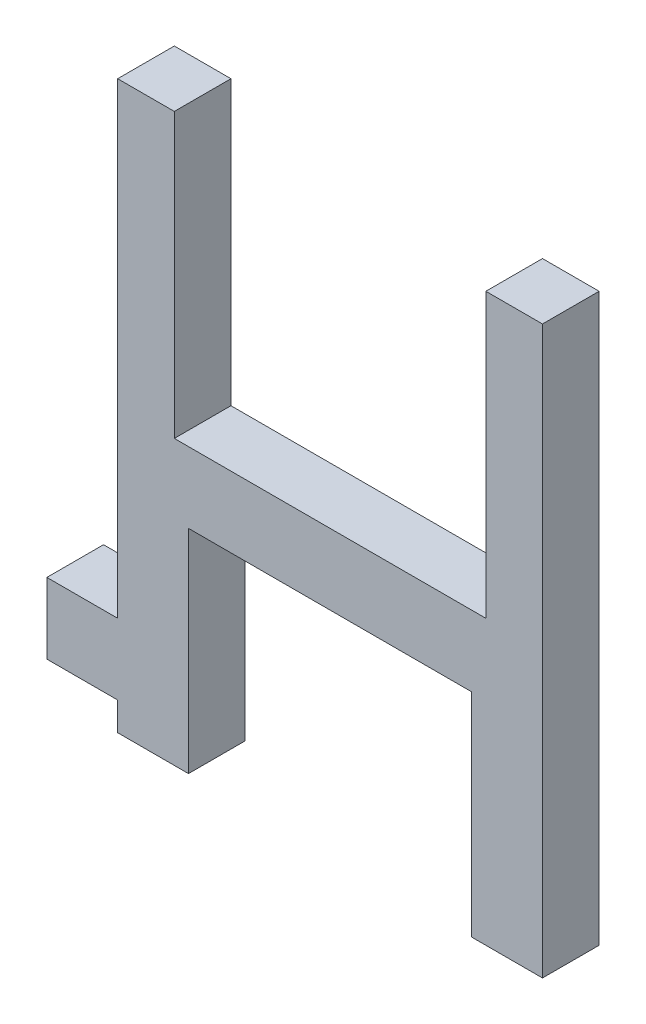
ISO-10303-21;
HEADER;
FILE_DESCRIPTION(('STEP AP214'),'2;1');
FILE_NAME('part.step','',(''),(''),'','','');
FILE_SCHEMA(('AUTOMOTIVE_DESIGN { 1 0 10303 214 1 1 1 1 }'));
ENDSEC;
DATA;
#1=APPLICATION_CONTEXT('core data for automotive mechanical design processes');
#2=APPLICATION_PROTOCOL_DEFINITION('international standard','automotive_design',2000,#1);
#3=PRODUCT_CONTEXT('',#1,'mechanical');
#4=PRODUCT('Part','Part','',(#3));
#5=PRODUCT_RELATED_PRODUCT_CATEGORY('part','',(#4));
#6=PRODUCT_DEFINITION_FORMATION('','',#4);
#7=PRODUCT_DEFINITION_CONTEXT('part definition',#1,'design');
#8=PRODUCT_DEFINITION('design','',#6,#7);
#9=PRODUCT_DEFINITION_SHAPE('','',#8);
#10=(LENGTH_UNIT() NAMED_UNIT(*) SI_UNIT(.MILLI.,.METRE.));
#11=(NAMED_UNIT(*) PLANE_ANGLE_UNIT() SI_UNIT($,.RADIAN.));
#12=(NAMED_UNIT(*) SI_UNIT($,.STERADIAN.) SOLID_ANGLE_UNIT());
#13=UNCERTAINTY_MEASURE_WITH_UNIT(LENGTH_MEASURE(1.E-05),#10,'distance_accuracy_value','');
#14=(GEOMETRIC_REPRESENTATION_CONTEXT(3) GLOBAL_UNCERTAINTY_ASSIGNED_CONTEXT((#13)) GLOBAL_UNIT_ASSIGNED_CONTEXT((#10,
#11,#12)) REPRESENTATION_CONTEXT('',''));
#15=CARTESIAN_POINT('',(0.,0.,0.));
#16=DIRECTION('',(0.,0.,1.));
#17=DIRECTION('',(1.,0.,0.));
#18=AXIS2_PLACEMENT_3D('',#15,#16,#17);
#19=CARTESIAN_POINT('',(35.,18.,4.));
#20=DIRECTION('',(0.,-1.,0.));
#21=DIRECTION('',(1.,0.,0.));
#22=AXIS2_PLACEMENT_3D('',#19,#20,#21);
#23=PLANE('',#22);
#24=DIRECTION('',(0.,0.,1.));
#25=VECTOR('',#24,1.);
#26=CARTESIAN_POINT('',(31.,18.,0.));
#27=LINE('',#26,#25);
#28=CARTESIAN_POINT('',(31.,18.,0.));
#29=VERTEX_POINT('',#28);
#30=CARTESIAN_POINT('',(31.,18.,4.));
#31=VERTEX_POINT('',#30);
#32=EDGE_CURVE('E172',#29,#31,#27,.T.);
#33=ORIENTED_EDGE('',*,*,#32,.F.);
#34=DIRECTION('',(-1.,0.,0.));
#35=VECTOR('',#34,1.);
#36=CARTESIAN_POINT('',(35.,18.,0.));
#37=LINE('',#36,#35);
#38=CARTESIAN_POINT('',(9.,18.,0.));
#39=VERTEX_POINT('',#38);
#40=EDGE_CURVE('E156',#29,#39,#37,.T.);
#41=ORIENTED_EDGE('',*,*,#40,.T.);
#42=DIRECTION('',(0.,0.,-1.));
#43=VECTOR('',#42,1.);
#44=CARTESIAN_POINT('',(9.,18.,0.));
#45=LINE('',#44,#43);
#46=CARTESIAN_POINT('',(9.,18.,4.));
#47=VERTEX_POINT('',#46);
#48=EDGE_CURVE('E181',#47,#39,#45,.T.);
#49=ORIENTED_EDGE('',*,*,#48,.F.);
#50=DIRECTION('',(-1.,0.,0.));
#51=VECTOR('',#50,1.);
#52=CARTESIAN_POINT('',(35.,18.,4.));
#53=LINE('',#52,#51);
#54=EDGE_CURVE('E47',#31,#47,#53,.T.);
#55=ORIENTED_EDGE('',*,*,#54,.F.);
#56=EDGE_LOOP('',(#33,#41,#49,#55));
#57=FACE_BOUND('',#56,.T.);
#58=ADVANCED_FACE('F32',(#57),#23,.F.);
#59=CARTESIAN_POINT('',(0.,5.,4.));
#60=DIRECTION('',(1.,0.,0.));
#61=DIRECTION('',(0.,0.,-1.));
#62=AXIS2_PLACEMENT_3D('',#59,#60,#61);
#63=PLANE('',#62);
#64=DIRECTION('',(0.,-1.,0.));
#65=VECTOR('',#64,1.);
#66=CARTESIAN_POINT('',(0.,5.,0.));
#67=LINE('',#66,#65);
#68=CARTESIAN_POINT('',(0.,5.,0.));
#69=VERTEX_POINT('',#68);
#70=CARTESIAN_POINT('',(0.,0.,0.));
#71=VERTEX_POINT('',#70);
#72=EDGE_CURVE('E200',#69,#71,#67,.T.);
#73=ORIENTED_EDGE('',*,*,#72,.T.);
#74=DIRECTION('',(0.,0.,-1.));
#75=VECTOR('',#74,1.);
#76=CARTESIAN_POINT('',(0.,0.,4.));
#77=LINE('',#76,#75);
#78=CARTESIAN_POINT('',(0.,0.,4.));
#79=VERTEX_POINT('',#78);
#80=EDGE_CURVE('E11',#79,#71,#77,.T.);
#81=ORIENTED_EDGE('',*,*,#80,.F.);
#82=DIRECTION('',(0.,-1.,0.));
#83=VECTOR('',#82,1.);
#84=CARTESIAN_POINT('',(0.,5.,4.));
#85=LINE('',#84,#83);
#86=CARTESIAN_POINT('',(0.,5.,4.));
#87=VERTEX_POINT('',#86);
#88=EDGE_CURVE('E201',#87,#79,#85,.T.);
#89=ORIENTED_EDGE('',*,*,#88,.F.);
#90=DIRECTION('',(0.,0.,-1.));
#91=VECTOR('',#90,1.);
#92=CARTESIAN_POINT('',(0.,5.,4.));
#93=LINE('',#92,#91);
#94=EDGE_CURVE('E226',#87,#69,#93,.T.);
#95=ORIENTED_EDGE('',*,*,#94,.T.);
#96=EDGE_LOOP('',(#73,#81,#89,#95));
#97=FACE_BOUND('',#96,.T.);
#98=ADVANCED_FACE('F34',(#97),#63,.F.);
#99=CARTESIAN_POINT('',(0.,0.,4.));
#100=DIRECTION('',(0.,1.,0.));
#101=DIRECTION('',(-1.,0.,0.));
#102=AXIS2_PLACEMENT_3D('',#99,#100,#101);
#103=PLANE('',#102);
#104=DIRECTION('',(1.,0.,0.));
#105=VECTOR('',#104,1.);
#106=CARTESIAN_POINT('',(0.,0.,0.));
#107=LINE('',#106,#105);
#108=CARTESIAN_POINT('',(5.,0.,0.));
#109=VERTEX_POINT('',#108);
#110=EDGE_CURVE('E229',#71,#109,#107,.T.);
#111=ORIENTED_EDGE('',*,*,#110,.T.);
#112=DIRECTION('',(0.,0.,-1.));
#113=VECTOR('',#112,1.);
#114=CARTESIAN_POINT('',(5.,0.,4.));
#115=LINE('',#114,#113);
#116=CARTESIAN_POINT('',(5.,0.,4.));
#117=VERTEX_POINT('',#116);
#118=EDGE_CURVE('E40',#117,#109,#115,.T.);
#119=ORIENTED_EDGE('',*,*,#118,.F.);
#120=DIRECTION('',(1.,0.,0.));
#121=VECTOR('',#120,1.);
#122=CARTESIAN_POINT('',(0.,0.,4.));
#123=LINE('',#122,#121);
#124=EDGE_CURVE('E204',#79,#117,#123,.T.);
#125=ORIENTED_EDGE('',*,*,#124,.F.);
#126=ORIENTED_EDGE('',*,*,#80,.T.);
#127=EDGE_LOOP('',(#111,#119,#125,#126));
#128=FACE_BOUND('',#127,.T.);
#129=ADVANCED_FACE('F291',(#128),#103,.F.);
#130=CARTESIAN_POINT('',(5.,0.,4.));
#131=DIRECTION('',(1.,0.,0.));
#132=DIRECTION('',(0.,0.,-1.));
#133=AXIS2_PLACEMENT_3D('',#130,#131,#132);
#134=PLANE('',#133);
#135=DIRECTION('',(0.,-1.,0.));
#136=VECTOR('',#135,1.);
#137=CARTESIAN_POINT('',(5.,0.,0.));
#138=LINE('',#137,#136);
#139=CARTESIAN_POINT('',(5.,-2.,0.));
#140=VERTEX_POINT('',#139);
#141=EDGE_CURVE('E231',#109,#140,#138,.T.);
#142=ORIENTED_EDGE('',*,*,#141,.T.);
#143=DIRECTION('',(0.,0.,-1.));
#144=VECTOR('',#143,1.);
#145=CARTESIAN_POINT('',(5.,-2.,4.));
#146=LINE('',#145,#144);
#147=CARTESIAN_POINT('',(5.,-2.,4.));
#148=VERTEX_POINT('',#147);
#149=EDGE_CURVE('E265',#148,#140,#146,.T.);
#150=ORIENTED_EDGE('',*,*,#149,.F.);
#151=DIRECTION('',(0.,-1.,0.));
#152=VECTOR('',#151,1.);
#153=CARTESIAN_POINT('',(5.,0.,4.));
#154=LINE('',#153,#152);
#155=EDGE_CURVE('E207',#117,#148,#154,.T.);
#156=ORIENTED_EDGE('',*,*,#155,.F.);
#157=ORIENTED_EDGE('',*,*,#118,.T.);
#158=EDGE_LOOP('',(#142,#150,#156,#157));
#159=FACE_BOUND('',#158,.T.);
#160=ADVANCED_FACE('F272',(#159),#134,.F.);
#161=CARTESIAN_POINT('',(5.,-2.,4.));
#162=DIRECTION('',(0.,1.,0.));
#163=DIRECTION('',(-1.,0.,0.));
#164=AXIS2_PLACEMENT_3D('',#161,#162,#163);
#165=PLANE('',#164);
#166=DIRECTION('',(1.,0.,0.));
#167=VECTOR('',#166,1.);
#168=CARTESIAN_POINT('',(5.,-2.,0.));
#169=LINE('',#168,#167);
#170=CARTESIAN_POINT('',(10.,-2.,0.));
#171=VERTEX_POINT('',#170);
#172=EDGE_CURVE('E233',#140,#171,#169,.T.);
#173=ORIENTED_EDGE('',*,*,#172,.T.);
#174=DIRECTION('',(0.,0.,-1.));
#175=VECTOR('',#174,1.);
#176=CARTESIAN_POINT('',(10.,-2.,4.));
#177=LINE('',#176,#175);
#178=CARTESIAN_POINT('',(10.,-2.,4.));
#179=VERTEX_POINT('',#178);
#180=EDGE_CURVE('E262',#179,#171,#177,.T.);
#181=ORIENTED_EDGE('',*,*,#180,.F.);
#182=DIRECTION('',(1.,0.,0.));
#183=VECTOR('',#182,1.);
#184=CARTESIAN_POINT('',(5.,-2.,4.));
#185=LINE('',#184,#183);
#186=EDGE_CURVE('E209',#148,#179,#185,.T.);
#187=ORIENTED_EDGE('',*,*,#186,.F.);
#188=ORIENTED_EDGE('',*,*,#149,.T.);
#189=EDGE_LOOP('',(#173,#181,#187,#188));
#190=FACE_BOUND('',#189,.T.);
#191=ADVANCED_FACE('F280',(#190),#165,.F.);
#192=CARTESIAN_POINT('',(10.,4.08247422680412,4.));
#193=DIRECTION('',(-1.,0.,0.));
#194=DIRECTION('',(0.,0.,1.));
#195=AXIS2_PLACEMENT_3D('',#192,#193,#194);
#196=PLANE('',#195);
#197=DIRECTION('',(0.,1.,0.));
#198=VECTOR('',#197,1.);
#199=CARTESIAN_POINT('',(10.,4.08247422680412,0.));
#200=LINE('',#199,#198);
#201=CARTESIAN_POINT('',(10.,13.,0.));
#202=VERTEX_POINT('',#201);
#203=EDGE_CURVE('E236',#171,#202,#200,.T.);
#204=ORIENTED_EDGE('',*,*,#203,.T.);
#205=DIRECTION('',(0.,0.,-1.));
#206=VECTOR('',#205,1.);
#207=CARTESIAN_POINT('',(10.,13.,4.));
#208=LINE('',#207,#206);
#209=CARTESIAN_POINT('',(10.,13.,4.));
#210=VERTEX_POINT('',#209);
#211=EDGE_CURVE('E259',#210,#202,#208,.T.);
#212=ORIENTED_EDGE('',*,*,#211,.F.);
#213=DIRECTION('',(0.,1.,0.));
#214=VECTOR('',#213,1.);
#215=CARTESIAN_POINT('',(10.,-2.,4.));
#216=LINE('',#215,#214);
#217=EDGE_CURVE('E211',#179,#210,#216,.T.);
#218=ORIENTED_EDGE('',*,*,#217,.F.);
#219=ORIENTED_EDGE('',*,*,#180,.T.);
#220=EDGE_LOOP('',(#204,#212,#218,#219));
#221=FACE_BOUND('',#220,.T.);
#222=ADVANCED_FACE('F284',(#221),#196,.F.);
#223=CARTESIAN_POINT('',(10.,13.,4.));
#224=DIRECTION('',(0.,1.,0.));
#225=DIRECTION('',(-1.,0.,0.));
#226=AXIS2_PLACEMENT_3D('',#223,#224,#225);
#227=PLANE('',#226);
#228=DIRECTION('',(1.,0.,0.));
#229=VECTOR('',#228,1.);
#230=CARTESIAN_POINT('',(10.,13.,0.));
#231=LINE('',#230,#229);
#232=CARTESIAN_POINT('',(30.,13.,0.));
#233=VERTEX_POINT('',#232);
#234=EDGE_CURVE('E238',#202,#233,#231,.T.);
#235=ORIENTED_EDGE('',*,*,#234,.T.);
#236=DIRECTION('',(0.,0.,-1.));
#237=VECTOR('',#236,1.);
#238=CARTESIAN_POINT('',(30.,13.,4.));
#239=LINE('',#238,#237);
#240=CARTESIAN_POINT('',(30.,13.,4.));
#241=VERTEX_POINT('',#240);
#242=EDGE_CURVE('E256',#241,#233,#239,.T.);
#243=ORIENTED_EDGE('',*,*,#242,.F.);
#244=DIRECTION('',(1.,0.,0.));
#245=VECTOR('',#244,1.);
#246=CARTESIAN_POINT('',(10.,13.,4.));
#247=LINE('',#246,#245);
#248=EDGE_CURVE('E213',#210,#241,#247,.T.);
#249=ORIENTED_EDGE('',*,*,#248,.F.);
#250=ORIENTED_EDGE('',*,*,#211,.T.);
#251=EDGE_LOOP('',(#235,#243,#249,#250));
#252=FACE_BOUND('',#251,.T.);
#253=ADVANCED_FACE('F322',(#252),#227,.F.);
#254=CARTESIAN_POINT('',(30.,13.,4.));
#255=DIRECTION('',(1.,0.,0.));
#256=DIRECTION('',(0.,0.,-1.));
#257=AXIS2_PLACEMENT_3D('',#254,#255,#256);
#258=PLANE('',#257);
#259=DIRECTION('',(0.,-1.,0.));
#260=VECTOR('',#259,1.);
#261=CARTESIAN_POINT('',(30.,13.,0.));
#262=LINE('',#261,#260);
#263=CARTESIAN_POINT('',(30.,-2.,0.));
#264=VERTEX_POINT('',#263);
#265=EDGE_CURVE('E240',#233,#264,#262,.T.);
#266=ORIENTED_EDGE('',*,*,#265,.T.);
#267=DIRECTION('',(0.,0.,-1.));
#268=VECTOR('',#267,1.);
#269=CARTESIAN_POINT('',(30.,-2.,4.));
#270=LINE('',#269,#268);
#271=CARTESIAN_POINT('',(30.,-2.,4.));
#272=VERTEX_POINT('',#271);
#273=EDGE_CURVE('E253',#272,#264,#270,.T.);
#274=ORIENTED_EDGE('',*,*,#273,.F.);
#275=DIRECTION('',(0.,-1.,0.));
#276=VECTOR('',#275,1.);
#277=CARTESIAN_POINT('',(30.,13.,4.));
#278=LINE('',#277,#276);
#279=EDGE_CURVE('E215',#241,#272,#278,.T.);
#280=ORIENTED_EDGE('',*,*,#279,.F.);
#281=ORIENTED_EDGE('',*,*,#242,.T.);
#282=EDGE_LOOP('',(#266,#274,#280,#281));
#283=FACE_BOUND('',#282,.T.);
#284=ADVANCED_FACE('F320',(#283),#258,.F.);
#285=CARTESIAN_POINT('',(30.,-2.,4.));
#286=DIRECTION('',(0.,1.,0.));
#287=DIRECTION('',(0.,0.,1.));
#288=AXIS2_PLACEMENT_3D('',#285,#286,#287);
#289=PLANE('',#288);
#290=DIRECTION('',(1.,0.,0.));
#291=VECTOR('',#290,1.);
#292=CARTESIAN_POINT('',(30.,-2.,0.));
#293=LINE('',#292,#291);
#294=CARTESIAN_POINT('',(35.,-2.,0.));
#295=VERTEX_POINT('',#294);
#296=EDGE_CURVE('E157',#264,#295,#293,.T.);
#297=ORIENTED_EDGE('',*,*,#296,.T.);
#298=DIRECTION('',(0.,0.,-1.));
#299=VECTOR('',#298,1.);
#300=CARTESIAN_POINT('',(35.,-2.,4.));
#301=LINE('',#300,#299);
#302=CARTESIAN_POINT('',(35.,-2.,4.));
#303=VERTEX_POINT('',#302);
#304=EDGE_CURVE('E153',#303,#295,#301,.T.);
#305=ORIENTED_EDGE('',*,*,#304,.F.);
#306=DIRECTION('',(1.,0.,0.));
#307=VECTOR('',#306,1.);
#308=CARTESIAN_POINT('',(30.,-2.,4.));
#309=LINE('',#308,#307);
#310=EDGE_CURVE('E217',#272,#303,#309,.T.);
#311=ORIENTED_EDGE('',*,*,#310,.F.);
#312=ORIENTED_EDGE('',*,*,#273,.T.);
#313=EDGE_LOOP('',(#297,#305,#311,#312));
#314=FACE_BOUND('',#313,.T.);
#315=ADVANCED_FACE('F317',(#314),#289,.F.);
#316=CARTESIAN_POINT('',(35.,-2.,4.));
#317=DIRECTION('',(-1.,0.,0.));
#318=DIRECTION('',(0.,0.,1.));
#319=AXIS2_PLACEMENT_3D('',#316,#317,#318);
#320=PLANE('',#319);
#321=DIRECTION('',(0.,1.,0.));
#322=VECTOR('',#321,1.);
#323=CARTESIAN_POINT('',(35.,-2.,0.));
#324=LINE('',#323,#322);
#325=CARTESIAN_POINT('',(35.,38.,0.));
#326=VERTEX_POINT('',#325);
#327=EDGE_CURVE('E146',#295,#326,#324,.T.);
#328=ORIENTED_EDGE('',*,*,#327,.T.);
#329=DIRECTION('',(0.,0.,-1.));
#330=VECTOR('',#329,1.);
#331=CARTESIAN_POINT('',(35.,38.,0.));
#332=LINE('',#331,#330);
#333=CARTESIAN_POINT('',(35.,38.,4.));
#334=VERTEX_POINT('',#333);
#335=EDGE_CURVE('E151',#334,#326,#332,.T.);
#336=ORIENTED_EDGE('',*,*,#335,.F.);
#337=DIRECTION('',(0.,1.,0.));
#338=VECTOR('',#337,1.);
#339=CARTESIAN_POINT('',(35.,-2.,4.));
#340=LINE('',#339,#338);
#341=EDGE_CURVE('E219',#303,#334,#340,.T.);
#342=ORIENTED_EDGE('',*,*,#341,.F.);
#343=ORIENTED_EDGE('',*,*,#304,.T.);
#344=EDGE_LOOP('',(#328,#336,#342,#343));
#345=FACE_BOUND('',#344,.T.);
#346=ADVANCED_FACE('F148',(#345),#320,.F.);
#347=CARTESIAN_POINT('',(5.,18.,4.));
#348=DIRECTION('',(1.,0.,0.));
#349=DIRECTION('',(0.,1.,0.));
#350=AXIS2_PLACEMENT_3D('',#347,#348,#349);
#351=PLANE('',#350);
#352=DIRECTION('',(0.,-1.,0.));
#353=VECTOR('',#352,1.);
#354=CARTESIAN_POINT('',(5.,18.,0.));
#355=LINE('',#354,#353);
#356=CARTESIAN_POINT('',(4.99999999999999,38.,0.));
#357=VERTEX_POINT('',#356);
#358=CARTESIAN_POINT('',(5.,5.,0.));
#359=VERTEX_POINT('',#358);
#360=EDGE_CURVE('E244',#357,#359,#355,.T.);
#361=ORIENTED_EDGE('',*,*,#360,.T.);
#362=DIRECTION('',(0.,0.,-1.));
#363=VECTOR('',#362,1.);
#364=CARTESIAN_POINT('',(5.,5.,4.));
#365=LINE('',#364,#363);
#366=CARTESIAN_POINT('',(5.,5.,4.));
#367=VERTEX_POINT('',#366);
#368=EDGE_CURVE('E249',#367,#359,#365,.T.);
#369=ORIENTED_EDGE('',*,*,#368,.F.);
#370=DIRECTION('',(0.,-1.,0.));
#371=VECTOR('',#370,1.);
#372=CARTESIAN_POINT('',(5.,18.,4.));
#373=LINE('',#372,#371);
#374=CARTESIAN_POINT('',(5.,38.,4.));
#375=VERTEX_POINT('',#374);
#376=EDGE_CURVE('E222',#375,#367,#373,.T.);
#377=ORIENTED_EDGE('',*,*,#376,.F.);
#378=DIRECTION('',(0.,0.,1.));
#379=VECTOR('',#378,1.);
#380=CARTESIAN_POINT('',(4.99999999999999,38.,0.));
#381=LINE('',#380,#379);
#382=EDGE_CURVE('E182',#357,#375,#381,.T.);
#383=ORIENTED_EDGE('',*,*,#382,.F.);
#384=EDGE_LOOP('',(#361,#369,#377,#383));
#385=FACE_BOUND('',#384,.T.);
#386=ADVANCED_FACE('F301',(#385),#351,.F.);
#387=CARTESIAN_POINT('',(5.,5.,4.));
#388=DIRECTION('',(0.,-1.,0.));
#389=DIRECTION('',(0.,0.,-1.));
#390=AXIS2_PLACEMENT_3D('',#387,#388,#389);
#391=PLANE('',#390);
#392=DIRECTION('',(-1.,0.,0.));
#393=VECTOR('',#392,1.);
#394=CARTESIAN_POINT('',(5.,5.,0.));
#395=LINE('',#394,#393);
#396=EDGE_CURVE('E205',#359,#69,#395,.T.);
#397=ORIENTED_EDGE('',*,*,#396,.T.);
#398=ORIENTED_EDGE('',*,*,#94,.F.);
#399=DIRECTION('',(-1.,0.,0.));
#400=VECTOR('',#399,1.);
#401=CARTESIAN_POINT('',(5.,5.,4.));
#402=LINE('',#401,#400);
#403=EDGE_CURVE('E224',#367,#87,#402,.T.);
#404=ORIENTED_EDGE('',*,*,#403,.F.);
#405=ORIENTED_EDGE('',*,*,#368,.T.);
#406=EDGE_LOOP('',(#397,#398,#404,#405));
#407=FACE_BOUND('',#406,.T.);
#408=ADVANCED_FACE('F297',(#407),#391,.F.);
#409=CARTESIAN_POINT('',(0.,0.,4.));
#410=DIRECTION('',(0.,0.,1.));
#411=DIRECTION('',(1.,0.,0.));
#412=AXIS2_PLACEMENT_3D('',#409,#410,#411);
#413=PLANE('',#412);
#414=ORIENTED_EDGE('',*,*,#341,.T.);
#415=DIRECTION('',(1.,0.,0.));
#416=VECTOR('',#415,1.);
#417=CARTESIAN_POINT('',(35.,38.,4.));
#418=LINE('',#417,#416);
#419=CARTESIAN_POINT('',(31.,38.,4.));
#420=VERTEX_POINT('',#419);
#421=EDGE_CURVE('E171',#420,#334,#418,.T.);
#422=ORIENTED_EDGE('',*,*,#421,.F.);
#423=DIRECTION('',(0.,-1.,0.));
#424=VECTOR('',#423,1.);
#425=CARTESIAN_POINT('',(31.,38.,4.));
#426=LINE('',#425,#424);
#427=EDGE_CURVE('E177',#420,#31,#426,.T.);
#428=ORIENTED_EDGE('',*,*,#427,.T.);
#429=ORIENTED_EDGE('',*,*,#54,.T.);
#430=DIRECTION('',(0.,-1.,0.));
#431=VECTOR('',#430,1.);
#432=CARTESIAN_POINT('',(9.,38.,4.));
#433=LINE('',#432,#431);
#434=CARTESIAN_POINT('',(9.,38.,4.));
#435=VERTEX_POINT('',#434);
#436=EDGE_CURVE('E197',#435,#47,#433,.T.);
#437=ORIENTED_EDGE('',*,*,#436,.F.);
#438=DIRECTION('',(1.,0.,0.));
#439=VECTOR('',#438,1.);
#440=CARTESIAN_POINT('',(5.,38.,4.));
#441=LINE('',#440,#439);
#442=EDGE_CURVE('E185',#375,#435,#441,.T.);
#443=ORIENTED_EDGE('',*,*,#442,.F.);
#444=ORIENTED_EDGE('',*,*,#376,.T.);
#445=ORIENTED_EDGE('',*,*,#403,.T.);
#446=ORIENTED_EDGE('',*,*,#88,.T.);
#447=ORIENTED_EDGE('',*,*,#124,.T.);
#448=ORIENTED_EDGE('',*,*,#155,.T.);
#449=ORIENTED_EDGE('',*,*,#186,.T.);
#450=ORIENTED_EDGE('',*,*,#217,.T.);
#451=ORIENTED_EDGE('',*,*,#248,.T.);
#452=ORIENTED_EDGE('',*,*,#279,.T.);
#453=ORIENTED_EDGE('',*,*,#310,.T.);
#454=EDGE_LOOP('',(#414,#422,#428,#429,#437,#443,#444,#445,#446,#447,#448,#449,#450,#451,#452,#453));
#455=FACE_BOUND('',#454,.T.);
#456=ADVANCED_FACE('F287',(#455),#413,.T.);
#457=CARTESIAN_POINT('',(0.,0.,0.));
#458=DIRECTION('',(0.,0.,1.));
#459=DIRECTION('',(1.,0.,0.));
#460=AXIS2_PLACEMENT_3D('',#457,#458,#459);
#461=PLANE('',#460);
#462=ORIENTED_EDGE('',*,*,#360,.F.);
#463=DIRECTION('',(-1.,0.,0.));
#464=VECTOR('',#463,1.);
#465=CARTESIAN_POINT('',(4.99999999999999,38.,0.));
#466=LINE('',#465,#464);
#467=CARTESIAN_POINT('',(9.,38.,0.));
#468=VERTEX_POINT('',#467);
#469=EDGE_CURVE('E189',#468,#357,#466,.T.);
#470=ORIENTED_EDGE('',*,*,#469,.F.);
#471=DIRECTION('',(0.,-1.,0.));
#472=VECTOR('',#471,1.);
#473=CARTESIAN_POINT('',(9.,38.,0.));
#474=LINE('',#473,#472);
#475=EDGE_CURVE('E192',#468,#39,#474,.T.);
#476=ORIENTED_EDGE('',*,*,#475,.T.);
#477=ORIENTED_EDGE('',*,*,#40,.F.);
#478=DIRECTION('',(0.,-1.,0.));
#479=VECTOR('',#478,1.);
#480=CARTESIAN_POINT('',(31.,38.,0.));
#481=LINE('',#480,#479);
#482=CARTESIAN_POINT('',(31.,38.,0.));
#483=VERTEX_POINT('',#482);
#484=EDGE_CURVE('E163',#483,#29,#481,.T.);
#485=ORIENTED_EDGE('',*,*,#484,.F.);
#486=DIRECTION('',(-1.,0.,0.));
#487=VECTOR('',#486,1.);
#488=CARTESIAN_POINT('',(35.,38.,0.));
#489=LINE('',#488,#487);
#490=EDGE_CURVE('E160',#326,#483,#489,.T.);
#491=ORIENTED_EDGE('',*,*,#490,.F.);
#492=ORIENTED_EDGE('',*,*,#327,.F.);
#493=ORIENTED_EDGE('',*,*,#296,.F.);
#494=ORIENTED_EDGE('',*,*,#265,.F.);
#495=ORIENTED_EDGE('',*,*,#234,.F.);
#496=ORIENTED_EDGE('',*,*,#203,.F.);
#497=ORIENTED_EDGE('',*,*,#172,.F.);
#498=ORIENTED_EDGE('',*,*,#141,.F.);
#499=ORIENTED_EDGE('',*,*,#110,.F.);
#500=ORIENTED_EDGE('',*,*,#72,.F.);
#501=ORIENTED_EDGE('',*,*,#396,.F.);
#502=EDGE_LOOP('',(#462,#470,#476,#477,#485,#491,#492,#493,#494,#495,#496,#497,#498,#499,#500,#501));
#503=FACE_BOUND('',#502,.T.);
#504=ADVANCED_FACE('F161',(#503),#461,.F.);
#505=CARTESIAN_POINT('',(9.,38.,0.));
#506=DIRECTION('',(-1.,0.,0.));
#507=DIRECTION('',(0.,0.,1.));
#508=AXIS2_PLACEMENT_3D('',#505,#506,#507);
#509=PLANE('',#508);
#510=ORIENTED_EDGE('',*,*,#48,.T.);
#511=ORIENTED_EDGE('',*,*,#475,.F.);
#512=DIRECTION('',(0.,0.,-1.));
#513=VECTOR('',#512,1.);
#514=CARTESIAN_POINT('',(9.,38.,0.));
#515=LINE('',#514,#513);
#516=EDGE_CURVE('E187',#435,#468,#515,.T.);
#517=ORIENTED_EDGE('',*,*,#516,.F.);
#518=ORIENTED_EDGE('',*,*,#436,.T.);
#519=EDGE_LOOP('',(#510,#511,#517,#518));
#520=FACE_BOUND('',#519,.T.);
#521=ADVANCED_FACE('F309',(#520),#509,.F.);
#522=CARTESIAN_POINT('',(0.,38.,0.));
#523=DIRECTION('',(0.,1.,0.));
#524=DIRECTION('',(0.,0.,1.));
#525=AXIS2_PLACEMENT_3D('',#522,#523,#524);
#526=PLANE('',#525);
#527=ORIENTED_EDGE('',*,*,#382,.T.);
#528=ORIENTED_EDGE('',*,*,#442,.T.);
#529=ORIENTED_EDGE('',*,*,#516,.T.);
#530=ORIENTED_EDGE('',*,*,#469,.T.);
#531=EDGE_LOOP('',(#527,#528,#529,#530));
#532=FACE_BOUND('',#531,.T.);
#533=ADVANCED_FACE('F305',(#532),#526,.T.);
#534=CARTESIAN_POINT('',(31.,38.,0.));
#535=DIRECTION('',(1.,0.,0.));
#536=DIRECTION('',(0.,1.,0.));
#537=AXIS2_PLACEMENT_3D('',#534,#535,#536);
#538=PLANE('',#537);
#539=ORIENTED_EDGE('',*,*,#32,.T.);
#540=ORIENTED_EDGE('',*,*,#427,.F.);
#541=DIRECTION('',(0.,0.,1.));
#542=VECTOR('',#541,1.);
#543=CARTESIAN_POINT('',(31.,38.,0.));
#544=LINE('',#543,#542);
#545=EDGE_CURVE('E166',#483,#420,#544,.T.);
#546=ORIENTED_EDGE('',*,*,#545,.F.);
#547=ORIENTED_EDGE('',*,*,#484,.T.);
#548=EDGE_LOOP('',(#539,#540,#546,#547));
#549=FACE_BOUND('',#548,.T.);
#550=ADVANCED_FACE('F312',(#549),#538,.F.);
#551=CARTESIAN_POINT('',(0.,38.,0.));
#552=DIRECTION('',(0.,-1.,0.));
#553=DIRECTION('',(0.,0.,-1.));
#554=AXIS2_PLACEMENT_3D('',#551,#552,#553);
#555=PLANE('',#554);
#556=ORIENTED_EDGE('',*,*,#335,.T.);
#557=ORIENTED_EDGE('',*,*,#490,.T.);
#558=ORIENTED_EDGE('',*,*,#545,.T.);
#559=ORIENTED_EDGE('',*,*,#421,.T.);
#560=EDGE_LOOP('',(#556,#557,#558,#559));
#561=FACE_BOUND('',#560,.T.);
#562=ADVANCED_FACE('F169',(#561),#555,.F.);
#563=CLOSED_SHELL('',(#58,#98,#129,#160,#191,#222,#253,#284,#315,#346,#386,#408,#456,#504,#521,
#533,#550,#562));
#564=MANIFOLD_SOLID_BREP('B2',#563);
#565=ADVANCED_BREP_SHAPE_REPRESENTATION('',(#18,#564),#14);
#566=SHAPE_DEFINITION_REPRESENTATION(#9,#565);
ENDSEC;
END-ISO-10303-21;
